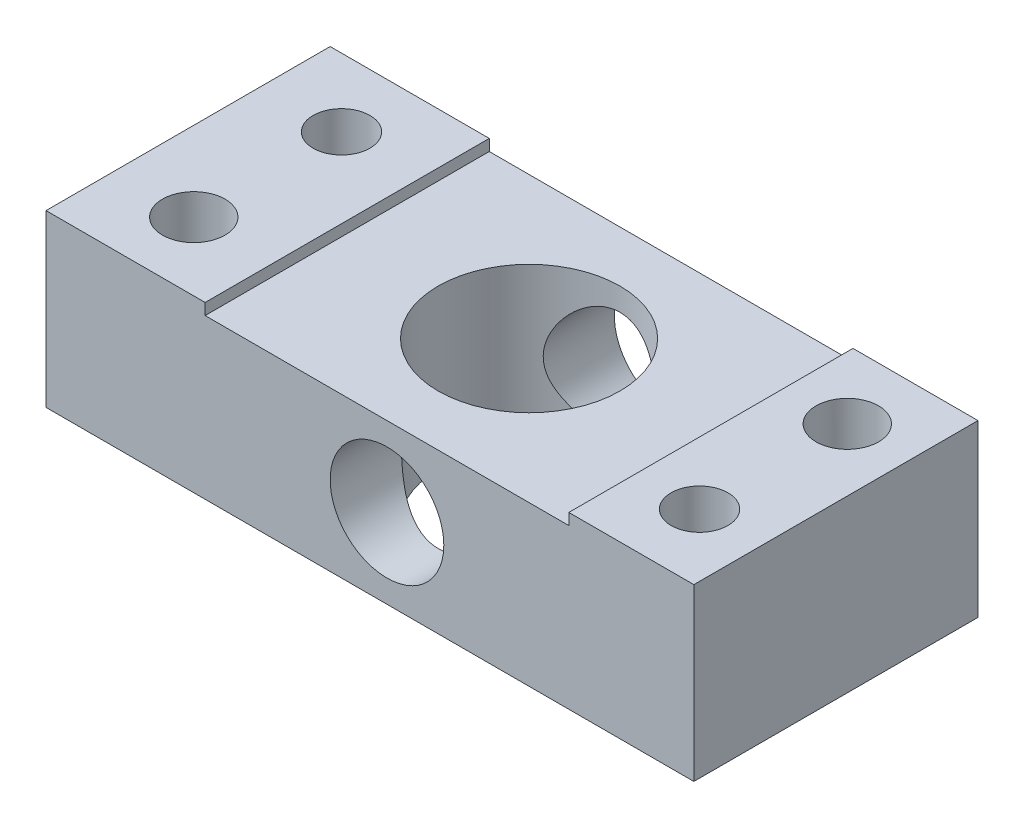
ISO-10303-21;
HEADER;
FILE_DESCRIPTION(('STEP AP214'),'2;1');
FILE_NAME('part.step','',(''),(''),'','','');
FILE_SCHEMA(('AUTOMOTIVE_DESIGN { 1 0 10303 214 1 1 1 1 }'));
ENDSEC;
DATA;
#1=APPLICATION_CONTEXT('core data for automotive mechanical design processes');
#2=APPLICATION_PROTOCOL_DEFINITION('international standard','automotive_design',2000,#1);
#3=PRODUCT_CONTEXT('',#1,'mechanical');
#4=PRODUCT('Part','Part','',(#3));
#5=PRODUCT_RELATED_PRODUCT_CATEGORY('part','',(#4));
#6=PRODUCT_DEFINITION_FORMATION('','',#4);
#7=PRODUCT_DEFINITION_CONTEXT('part definition',#1,'design');
#8=PRODUCT_DEFINITION('design','',#6,#7);
#9=PRODUCT_DEFINITION_SHAPE('','',#8);
#10=(LENGTH_UNIT() NAMED_UNIT(*) SI_UNIT(.MILLI.,.METRE.));
#11=(NAMED_UNIT(*) PLANE_ANGLE_UNIT() SI_UNIT($,.RADIAN.));
#12=(NAMED_UNIT(*) SI_UNIT($,.STERADIAN.) SOLID_ANGLE_UNIT());
#13=UNCERTAINTY_MEASURE_WITH_UNIT(LENGTH_MEASURE(1.E-05),#10,'distance_accuracy_value','');
#14=(GEOMETRIC_REPRESENTATION_CONTEXT(3) GLOBAL_UNCERTAINTY_ASSIGNED_CONTEXT((#13)) GLOBAL_UNIT_ASSIGNED_CONTEXT((#10,
#11,#12)) REPRESENTATION_CONTEXT('',''));
#15=CARTESIAN_POINT('',(0.,0.,0.));
#16=DIRECTION('',(0.,0.,1.));
#17=DIRECTION('',(1.,0.,0.));
#18=AXIS2_PLACEMENT_3D('',#15,#16,#17);
#19=CARTESIAN_POINT('',(23.,58.7,-3.5));
#20=DIRECTION('',(0.,-1.,0.));
#21=DIRECTION('',(0.,0.,-1.));
#22=AXIS2_PLACEMENT_3D('',#19,#20,#21);
#23=CYLINDRICAL_SURFACE('',#22,2.75);
#24=CARTESIAN_POINT('',(23.,15.,-3.5));
#25=DIRECTION('',(0.,1.,0.));
#26=DIRECTION('',(0.,0.,1.));
#27=AXIS2_PLACEMENT_3D('',#24,#25,#26);
#28=CIRCLE('',#27,2.75);
#29=CARTESIAN_POINT('',(23.,15.,-0.750000000000002));
#30=VERTEX_POINT('',#29);
#31=EDGE_CURVE('E278',#30,#30,#28,.T.);
#32=ORIENTED_EDGE('',*,*,#31,.T.);
#33=EDGE_LOOP('',(#32));
#34=FACE_BOUND('',#33,.T.);
#35=CARTESIAN_POINT('',(23.,5.7,-3.5));
#36=DIRECTION('',(0.,-1.,0.));
#37=DIRECTION('',(0.,0.,-1.));
#38=AXIS2_PLACEMENT_3D('',#35,#36,#37);
#39=CIRCLE('',#38,2.75);
#40=CARTESIAN_POINT('',(23.,5.7,-6.25));
#41=VERTEX_POINT('',#40);
#42=EDGE_CURVE('E181',#41,#41,#39,.F.);
#43=ORIENTED_EDGE('',*,*,#42,.F.);
#44=EDGE_LOOP('',(#43));
#45=FACE_BOUND('',#44,.T.);
#46=ADVANCED_FACE('F33',(#34,#45),#23,.F.);
#47=CARTESIAN_POINT('',(-21.5,58.7,9.5));
#48=DIRECTION('',(0.,-1.,0.));
#49=DIRECTION('',(0.,0.,-1.));
#50=AXIS2_PLACEMENT_3D('',#47,#48,#49);
#51=CYLINDRICAL_SURFACE('',#50,2.75);
#52=CARTESIAN_POINT('',(-21.5,15.,9.5));
#53=DIRECTION('',(0.,1.,0.));
#54=DIRECTION('',(0.,0.,1.));
#55=AXIS2_PLACEMENT_3D('',#52,#53,#54);
#56=CIRCLE('',#55,2.75);
#57=CARTESIAN_POINT('',(-21.5,15.,12.25));
#58=VERTEX_POINT('',#57);
#59=EDGE_CURVE('E277',#58,#58,#56,.T.);
#60=ORIENTED_EDGE('',*,*,#59,.T.);
#61=EDGE_LOOP('',(#60));
#62=FACE_BOUND('',#61,.T.);
#63=CARTESIAN_POINT('',(-21.5,5.7,9.5));
#64=DIRECTION('',(0.,-1.,0.));
#65=DIRECTION('',(0.,0.,-1.));
#66=AXIS2_PLACEMENT_3D('',#63,#64,#65);
#67=CIRCLE('',#66,2.75);
#68=CARTESIAN_POINT('',(-21.5,5.7,6.75));
#69=VERTEX_POINT('',#68);
#70=EDGE_CURVE('E178',#69,#69,#67,.F.);
#71=ORIENTED_EDGE('',*,*,#70,.F.);
#72=EDGE_LOOP('',(#71));
#73=FACE_BOUND('',#72,.T.);
#74=ADVANCED_FACE('F212',(#62,#73),#51,.F.);
#75=CARTESIAN_POINT('',(0.,15.,0.));
#76=DIRECTION('',(0.,1.,0.));
#77=DIRECTION('',(0.,0.,1.));
#78=AXIS2_PLACEMENT_3D('',#75,#76,#77);
#79=PLANE('',#78);
#80=CARTESIAN_POINT('',(-21.5,15.,-3.5));
#81=DIRECTION('',(0.,1.,0.));
#82=DIRECTION('',(0.,0.,1.));
#83=AXIS2_PLACEMENT_3D('',#80,#81,#82);
#84=CIRCLE('',#83,2.5);
#85=CARTESIAN_POINT('',(-21.5,15.,-1.));
#86=VERTEX_POINT('',#85);
#87=EDGE_CURVE('E137',#86,#86,#84,.T.);
#88=ORIENTED_EDGE('',*,*,#87,.F.);
#89=EDGE_LOOP('',(#88));
#90=FACE_BOUND('',#89,.T.);
#91=ORIENTED_EDGE('',*,*,#59,.F.);
#92=EDGE_LOOP('',(#91));
#93=FACE_BOUND('',#92,.T.);
#94=DIRECTION('',(0.,0.,1.));
#95=VECTOR('',#94,1.);
#96=CARTESIAN_POINT('',(-14.5,15.,0.));
#97=LINE('',#96,#95);
#98=CARTESIAN_POINT('',(-14.5,15.,-9.5));
#99=VERTEX_POINT('',#98);
#100=CARTESIAN_POINT('',(-14.5,15.,15.5));
#101=VERTEX_POINT('',#100);
#102=EDGE_CURVE('E11',#99,#101,#97,.T.);
#103=ORIENTED_EDGE('',*,*,#102,.F.);
#104=DIRECTION('',(-1.,0.,0.));
#105=VECTOR('',#104,1.);
#106=CARTESIAN_POINT('',(-28.5,15.,-9.5));
#107=LINE('',#106,#105);
#108=CARTESIAN_POINT('',(-28.5,15.,-9.5));
#109=VERTEX_POINT('',#108);
#110=EDGE_CURVE('E57',#99,#109,#107,.T.);
#111=ORIENTED_EDGE('',*,*,#110,.T.);
#112=DIRECTION('',(0.,0.,1.));
#113=VECTOR('',#112,1.);
#114=CARTESIAN_POINT('',(-28.5,15.,-9.5));
#115=LINE('',#114,#113);
#116=CARTESIAN_POINT('',(-28.5,15.,15.5));
#117=VERTEX_POINT('',#116);
#118=EDGE_CURVE('E170',#109,#117,#115,.T.);
#119=ORIENTED_EDGE('',*,*,#118,.T.);
#120=DIRECTION('',(-1.,0.,0.));
#121=VECTOR('',#120,1.);
#122=CARTESIAN_POINT('',(-28.5,15.,15.5));
#123=LINE('',#122,#121);
#124=EDGE_CURVE('E133',#101,#117,#123,.T.);
#125=ORIENTED_EDGE('',*,*,#124,.F.);
#126=EDGE_LOOP('',(#103,#111,#119,#125));
#127=FACE_BOUND('',#126,.T.);
#128=ADVANCED_FACE('F218',(#90,#93,#127),#79,.T.);
#129=CARTESIAN_POINT('',(28.5,15.,-9.5));
#130=DIRECTION('',(-1.,0.,0.));
#131=DIRECTION('',(0.,0.,1.));
#132=AXIS2_PLACEMENT_3D('',#129,#130,#131);
#133=PLANE('',#132);
#134=DIRECTION('',(0.,0.,-1.));
#135=VECTOR('',#134,1.);
#136=CARTESIAN_POINT('',(28.5,0.,-9.5));
#137=LINE('',#136,#135);
#138=CARTESIAN_POINT('',(28.5,0.,15.5));
#139=VERTEX_POINT('',#138);
#140=CARTESIAN_POINT('',(28.5,0.,-9.5));
#141=VERTEX_POINT('',#140);
#142=EDGE_CURVE('E123',#139,#141,#137,.T.);
#143=ORIENTED_EDGE('',*,*,#142,.T.);
#144=DIRECTION('',(0.,-1.,0.));
#145=VECTOR('',#144,1.);
#146=CARTESIAN_POINT('',(28.5,15.,-9.5));
#147=LINE('',#146,#145);
#148=CARTESIAN_POINT('',(28.5,15.,-9.5));
#149=VERTEX_POINT('',#148);
#150=EDGE_CURVE('E175',#149,#141,#147,.T.);
#151=ORIENTED_EDGE('',*,*,#150,.F.);
#152=DIRECTION('',(0.,0.,-1.));
#153=VECTOR('',#152,1.);
#154=CARTESIAN_POINT('',(28.5,15.,-9.5));
#155=LINE('',#154,#153);
#156=CARTESIAN_POINT('',(28.5,15.,15.5));
#157=VERTEX_POINT('',#156);
#158=EDGE_CURVE('E117',#157,#149,#155,.T.);
#159=ORIENTED_EDGE('',*,*,#158,.F.);
#160=DIRECTION('',(0.,1.,0.));
#161=VECTOR('',#160,1.);
#162=CARTESIAN_POINT('',(28.5,15.,15.5));
#163=LINE('',#162,#161);
#164=EDGE_CURVE('E127',#139,#157,#163,.T.);
#165=ORIENTED_EDGE('',*,*,#164,.F.);
#166=EDGE_LOOP('',(#143,#151,#159,#165));
#167=FACE_BOUND('',#166,.T.);
#168=ADVANCED_FACE('F35',(#167),#133,.F.);
#169=CARTESIAN_POINT('',(-28.5,15.,-9.5));
#170=DIRECTION('',(0.,0.,1.));
#171=DIRECTION('',(1.,0.,0.));
#172=AXIS2_PLACEMENT_3D('',#169,#170,#171);
#173=PLANE('',#172);
#174=CARTESIAN_POINT('',(1.5,7.,-9.50000000000001));
#175=DIRECTION('',(0.,0.,1.));
#176=DIRECTION('',(1.,0.,0.));
#177=AXIS2_PLACEMENT_3D('',#174,#175,#176);
#178=CIRCLE('',#177,5.);
#179=CARTESIAN_POINT('',(6.50000000000001,7.,-9.50000000000001));
#180=VERTEX_POINT('',#179);
#181=EDGE_CURVE('E261',#180,#180,#178,.T.);
#182=ORIENTED_EDGE('',*,*,#181,.T.);
#183=EDGE_LOOP('',(#182));
#184=FACE_BOUND('',#183,.T.);
#185=ORIENTED_EDGE('',*,*,#110,.F.);
#186=DIRECTION('',(0.,-1.,0.));
#187=VECTOR('',#186,1.);
#188=CARTESIAN_POINT('',(-14.5,15.,-9.5));
#189=LINE('',#188,#187);
#190=CARTESIAN_POINT('',(-14.5,14.,-9.5));
#191=VERTEX_POINT('',#190);
#192=EDGE_CURVE('E161',#99,#191,#189,.T.);
#193=ORIENTED_EDGE('',*,*,#192,.T.);
#194=DIRECTION('',(1.,0.,0.));
#195=VECTOR('',#194,1.);
#196=CARTESIAN_POINT('',(-28.5,14.,-9.5));
#197=LINE('',#196,#195);
#198=CARTESIAN_POINT('',(17.5,14.,-9.5));
#199=VERTEX_POINT('',#198);
#200=EDGE_CURVE('E77',#191,#199,#197,.T.);
#201=ORIENTED_EDGE('',*,*,#200,.T.);
#202=DIRECTION('',(0.,1.,0.));
#203=VECTOR('',#202,1.);
#204=CARTESIAN_POINT('',(17.5,14.9999999999998,-9.5));
#205=LINE('',#204,#203);
#206=CARTESIAN_POINT('',(17.5,15.,-9.5));
#207=VERTEX_POINT('',#206);
#208=EDGE_CURVE('E157',#199,#207,#205,.T.);
#209=ORIENTED_EDGE('',*,*,#208,.T.);
#210=EDGE_CURVE('E167',#149,#207,#107,.T.);
#211=ORIENTED_EDGE('',*,*,#210,.F.);
#212=ORIENTED_EDGE('',*,*,#150,.T.);
#213=DIRECTION('',(-1.,0.,0.));
#214=VECTOR('',#213,1.);
#215=CARTESIAN_POINT('',(-28.5,0.,-9.5));
#216=LINE('',#215,#214);
#217=CARTESIAN_POINT('',(-28.5,0.,-9.5));
#218=VERTEX_POINT('',#217);
#219=EDGE_CURVE('E69',#141,#218,#216,.T.);
#220=ORIENTED_EDGE('',*,*,#219,.T.);
#221=DIRECTION('',(0.,-1.,0.));
#222=VECTOR('',#221,1.);
#223=CARTESIAN_POINT('',(-28.5,15.,-9.5));
#224=LINE('',#223,#222);
#225=EDGE_CURVE('E116',#109,#218,#224,.T.);
#226=ORIENTED_EDGE('',*,*,#225,.F.);
#227=EDGE_LOOP('',(#185,#193,#201,#209,#211,#212,#220,#226));
#228=FACE_BOUND('',#227,.T.);
#229=ADVANCED_FACE('F251',(#184,#228),#173,.F.);
#230=CARTESIAN_POINT('',(-28.5,15.,-9.5));
#231=DIRECTION('',(1.,0.,0.));
#232=DIRECTION('',(0.,0.,-1.));
#233=AXIS2_PLACEMENT_3D('',#230,#231,#232);
#234=PLANE('',#233);
#235=DIRECTION('',(0.,0.,1.));
#236=VECTOR('',#235,1.);
#237=CARTESIAN_POINT('',(-28.5,0.,-9.5));
#238=LINE('',#237,#236);
#239=CARTESIAN_POINT('',(-28.5,0.,15.5));
#240=VERTEX_POINT('',#239);
#241=EDGE_CURVE('E110',#218,#240,#238,.T.);
#242=ORIENTED_EDGE('',*,*,#241,.T.);
#243=DIRECTION('',(0.,-1.,0.));
#244=VECTOR('',#243,1.);
#245=CARTESIAN_POINT('',(-28.5,0.,15.5));
#246=LINE('',#245,#244);
#247=EDGE_CURVE('E115',#117,#240,#246,.T.);
#248=ORIENTED_EDGE('',*,*,#247,.F.);
#249=ORIENTED_EDGE('',*,*,#118,.F.);
#250=ORIENTED_EDGE('',*,*,#225,.T.);
#251=EDGE_LOOP('',(#242,#248,#249,#250));
#252=FACE_BOUND('',#251,.T.);
#253=ADVANCED_FACE('F112',(#252),#234,.F.);
#254=CARTESIAN_POINT('',(23.,15.,9.5));
#255=DIRECTION('',(0.,1.,0.));
#256=DIRECTION('',(0.,0.,1.));
#257=AXIS2_PLACEMENT_3D('',#254,#255,#256);
#258=CIRCLE('',#257,2.5);
#259=CARTESIAN_POINT('',(23.,15.,12.));
#260=VERTEX_POINT('',#259);
#261=EDGE_CURVE('E134',#260,#260,#258,.T.);
#262=ORIENTED_EDGE('',*,*,#261,.F.);
#263=EDGE_LOOP('',(#262));
#264=FACE_BOUND('',#263,.T.);
#265=ORIENTED_EDGE('',*,*,#31,.F.);
#266=EDGE_LOOP('',(#265));
#267=FACE_BOUND('',#266,.T.);
#268=DIRECTION('',(0.,0.,-1.));
#269=VECTOR('',#268,1.);
#270=CARTESIAN_POINT('',(17.5,15.,0.));
#271=LINE('',#270,#269);
#272=CARTESIAN_POINT('',(17.5,15.,15.5));
#273=VERTEX_POINT('',#272);
#274=EDGE_CURVE('E48',#273,#207,#271,.T.);
#275=ORIENTED_EDGE('',*,*,#274,.F.);
#276=DIRECTION('',(-1.,0.,0.));
#277=VECTOR('',#276,1.);
#278=CARTESIAN_POINT('',(17.5,15.,15.5));
#279=LINE('',#278,#277);
#280=EDGE_CURVE('E142',#157,#273,#279,.T.);
#281=ORIENTED_EDGE('',*,*,#280,.F.);
#282=ORIENTED_EDGE('',*,*,#158,.T.);
#283=ORIENTED_EDGE('',*,*,#210,.T.);
#284=EDGE_LOOP('',(#275,#281,#282,#283));
#285=FACE_BOUND('',#284,.T.);
#286=ADVANCED_FACE('F243',(#264,#267,#285),#79,.T.);
#287=CARTESIAN_POINT('',(0.,0.,0.));
#288=DIRECTION('',(0.,1.,0.));
#289=DIRECTION('',(0.,0.,1.));
#290=AXIS2_PLACEMENT_3D('',#287,#288,#289);
#291=PLANE('',#290);
#292=CARTESIAN_POINT('',(1.50000000000001,0.,3.));
#293=DIRECTION('',(0.,-1.,0.));
#294=DIRECTION('',(0.,0.,-1.));
#295=AXIS2_PLACEMENT_3D('',#292,#293,#294);
#296=CIRCLE('',#295,8.);
#297=CARTESIAN_POINT('',(1.50000000000001,0.,-5.));
#298=VERTEX_POINT('',#297);
#299=EDGE_CURVE('E189',#298,#298,#296,.T.);
#300=ORIENTED_EDGE('',*,*,#299,.F.);
#301=EDGE_LOOP('',(#300));
#302=FACE_BOUND('',#301,.T.);
#303=CARTESIAN_POINT('',(-21.5,0.,9.5));
#304=DIRECTION('',(0.,-1.,0.));
#305=DIRECTION('',(0.,0.,-1.));
#306=AXIS2_PLACEMENT_3D('',#303,#304,#305);
#307=CIRCLE('',#306,5.);
#308=CARTESIAN_POINT('',(-21.5,0.,4.5));
#309=VERTEX_POINT('',#308);
#310=EDGE_CURVE('E292',#309,#309,#307,.T.);
#311=ORIENTED_EDGE('',*,*,#310,.F.);
#312=EDGE_LOOP('',(#311));
#313=FACE_BOUND('',#312,.T.);
#314=CARTESIAN_POINT('',(23.,0.,-3.5));
#315=DIRECTION('',(0.,-1.,0.));
#316=DIRECTION('',(0.,0.,-1.));
#317=AXIS2_PLACEMENT_3D('',#314,#315,#316);
#318=CIRCLE('',#317,5.);
#319=CARTESIAN_POINT('',(23.,0.,-8.5));
#320=VERTEX_POINT('',#319);
#321=EDGE_CURVE('E188',#320,#320,#318,.T.);
#322=ORIENTED_EDGE('',*,*,#321,.F.);
#323=EDGE_LOOP('',(#322));
#324=FACE_BOUND('',#323,.T.);
#325=CARTESIAN_POINT('',(23.,0.,9.5));
#326=DIRECTION('',(0.,-1.,0.));
#327=DIRECTION('',(0.,0.,-1.));
#328=AXIS2_PLACEMENT_3D('',#325,#326,#327);
#329=CIRCLE('',#328,2.5);
#330=CARTESIAN_POINT('',(23.,0.,7.));
#331=VERTEX_POINT('',#330);
#332=EDGE_CURVE('E185',#331,#331,#329,.T.);
#333=ORIENTED_EDGE('',*,*,#332,.F.);
#334=EDGE_LOOP('',(#333));
#335=FACE_BOUND('',#334,.T.);
#336=CARTESIAN_POINT('',(-21.5,0.,-3.5));
#337=DIRECTION('',(0.,-1.,0.));
#338=DIRECTION('',(0.,0.,-1.));
#339=AXIS2_PLACEMENT_3D('',#336,#337,#338);
#340=CIRCLE('',#339,2.5);
#341=CARTESIAN_POINT('',(-21.5,0.,-6.));
#342=VERTEX_POINT('',#341);
#343=EDGE_CURVE('E280',#342,#342,#340,.T.);
#344=ORIENTED_EDGE('',*,*,#343,.F.);
#345=EDGE_LOOP('',(#344));
#346=FACE_BOUND('',#345,.T.);
#347=ORIENTED_EDGE('',*,*,#142,.F.);
#348=DIRECTION('',(1.,0.,0.));
#349=VECTOR('',#348,1.);
#350=CARTESIAN_POINT('',(28.5,0.,15.5));
#351=LINE('',#350,#349);
#352=EDGE_CURVE('E120',#240,#139,#351,.T.);
#353=ORIENTED_EDGE('',*,*,#352,.F.);
#354=ORIENTED_EDGE('',*,*,#241,.F.);
#355=ORIENTED_EDGE('',*,*,#219,.F.);
#356=EDGE_LOOP('',(#347,#353,#354,#355));
#357=FACE_BOUND('',#356,.T.);
#358=ADVANCED_FACE('F121',(#302,#313,#324,#335,#346,#357),#291,.F.);
#359=CARTESIAN_POINT('',(-14.5,14.,-12.5));
#360=DIRECTION('',(0.,-1.,0.));
#361=DIRECTION('',(0.,0.,-1.));
#362=AXIS2_PLACEMENT_3D('',#359,#360,#361);
#363=PLANE('',#362);
#364=CARTESIAN_POINT('',(1.50000000000001,14.,3.));
#365=DIRECTION('',(0.,-1.,0.));
#366=DIRECTION('',(0.,0.,-1.));
#367=AXIS2_PLACEMENT_3D('',#364,#365,#366);
#368=CIRCLE('',#367,8.);
#369=CARTESIAN_POINT('',(1.50000000000001,14.,-5.));
#370=VERTEX_POINT('',#369);
#371=EDGE_CURVE('E186',#370,#370,#368,.T.);
#372=ORIENTED_EDGE('',*,*,#371,.T.);
#373=EDGE_LOOP('',(#372));
#374=FACE_BOUND('',#373,.T.);
#375=DIRECTION('',(0.,0.,1.));
#376=VECTOR('',#375,1.);
#377=CARTESIAN_POINT('',(-14.5,14.,-12.5));
#378=LINE('',#377,#376);
#379=CARTESIAN_POINT('',(-14.5,14.,15.5));
#380=VERTEX_POINT('',#379);
#381=EDGE_CURVE('E154',#191,#380,#378,.T.);
#382=ORIENTED_EDGE('',*,*,#381,.T.);
#383=DIRECTION('',(-1.,0.,0.));
#384=VECTOR('',#383,1.);
#385=CARTESIAN_POINT('',(-14.5,14.,15.5));
#386=LINE('',#385,#384);
#387=CARTESIAN_POINT('',(17.5,14.,15.5));
#388=VERTEX_POINT('',#387);
#389=EDGE_CURVE('E148',#388,#380,#386,.T.);
#390=ORIENTED_EDGE('',*,*,#389,.F.);
#391=DIRECTION('',(0.,0.,1.));
#392=VECTOR('',#391,1.);
#393=CARTESIAN_POINT('',(17.5,14.,-12.5));
#394=LINE('',#393,#392);
#395=EDGE_CURVE('E155',#199,#388,#394,.T.);
#396=ORIENTED_EDGE('',*,*,#395,.F.);
#397=ORIENTED_EDGE('',*,*,#200,.F.);
#398=EDGE_LOOP('',(#382,#390,#396,#397));
#399=FACE_BOUND('',#398,.T.);
#400=ADVANCED_FACE('F236',(#374,#399),#363,.F.);
#401=CARTESIAN_POINT('',(-14.5,15.,-12.5));
#402=DIRECTION('',(-1.,0.,0.));
#403=DIRECTION('',(0.,0.,1.));
#404=AXIS2_PLACEMENT_3D('',#401,#402,#403);
#405=PLANE('',#404);
#406=ORIENTED_EDGE('',*,*,#102,.T.);
#407=DIRECTION('',(0.,1.,0.));
#408=VECTOR('',#407,1.);
#409=CARTESIAN_POINT('',(-14.5,15.,15.5));
#410=LINE('',#409,#408);
#411=EDGE_CURVE('E151',#380,#101,#410,.T.);
#412=ORIENTED_EDGE('',*,*,#411,.F.);
#413=ORIENTED_EDGE('',*,*,#381,.F.);
#414=ORIENTED_EDGE('',*,*,#192,.F.);
#415=EDGE_LOOP('',(#406,#412,#413,#414));
#416=FACE_BOUND('',#415,.T.);
#417=ADVANCED_FACE('F234',(#416),#405,.F.);
#418=CARTESIAN_POINT('',(17.5,15.,-12.5));
#419=DIRECTION('',(1.,0.,0.));
#420=DIRECTION('',(0.,1.,0.));
#421=AXIS2_PLACEMENT_3D('',#418,#419,#420);
#422=PLANE('',#421);
#423=ORIENTED_EDGE('',*,*,#395,.T.);
#424=DIRECTION('',(0.,-1.,0.));
#425=VECTOR('',#424,1.);
#426=CARTESIAN_POINT('',(17.5,14.,15.5));
#427=LINE('',#426,#425);
#428=EDGE_CURVE('E145',#273,#388,#427,.T.);
#429=ORIENTED_EDGE('',*,*,#428,.F.);
#430=ORIENTED_EDGE('',*,*,#274,.T.);
#431=ORIENTED_EDGE('',*,*,#208,.F.);
#432=EDGE_LOOP('',(#423,#429,#430,#431));
#433=FACE_BOUND('',#432,.T.);
#434=ADVANCED_FACE('F230',(#433),#422,.F.);
#435=CARTESIAN_POINT('',(0.,0.,15.5));
#436=DIRECTION('',(0.,0.,-1.));
#437=DIRECTION('',(-1.,0.,0.));
#438=AXIS2_PLACEMENT_3D('',#435,#436,#437);
#439=PLANE('',#438);
#440=CARTESIAN_POINT('',(1.5,7.,15.5));
#441=DIRECTION('',(0.,0.,1.));
#442=DIRECTION('',(1.,0.,0.));
#443=AXIS2_PLACEMENT_3D('',#440,#441,#442);
#444=CIRCLE('',#443,5.);
#445=CARTESIAN_POINT('',(6.50000000000001,7.,15.5));
#446=VERTEX_POINT('',#445);
#447=EDGE_CURVE('E195',#446,#446,#444,.T.);
#448=ORIENTED_EDGE('',*,*,#447,.F.);
#449=EDGE_LOOP('',(#448));
#450=FACE_BOUND('',#449,.T.);
#451=ORIENTED_EDGE('',*,*,#247,.T.);
#452=ORIENTED_EDGE('',*,*,#352,.T.);
#453=ORIENTED_EDGE('',*,*,#164,.T.);
#454=ORIENTED_EDGE('',*,*,#280,.T.);
#455=ORIENTED_EDGE('',*,*,#428,.T.);
#456=ORIENTED_EDGE('',*,*,#389,.T.);
#457=ORIENTED_EDGE('',*,*,#411,.T.);
#458=ORIENTED_EDGE('',*,*,#124,.T.);
#459=EDGE_LOOP('',(#451,#452,#453,#454,#455,#456,#457,#458));
#460=FACE_BOUND('',#459,.T.);
#461=ADVANCED_FACE('F130',(#450,#460),#439,.F.);
#462=CARTESIAN_POINT('',(-21.5,58.7,-3.5));
#463=DIRECTION('',(0.,-1.,0.));
#464=DIRECTION('',(0.,0.,-1.));
#465=AXIS2_PLACEMENT_3D('',#462,#463,#464);
#466=CYLINDRICAL_SURFACE('',#465,2.5);
#467=ORIENTED_EDGE('',*,*,#87,.T.);
#468=EDGE_LOOP('',(#467));
#469=FACE_BOUND('',#468,.T.);
#470=ORIENTED_EDGE('',*,*,#343,.T.);
#471=EDGE_LOOP('',(#470));
#472=FACE_BOUND('',#471,.T.);
#473=ADVANCED_FACE('F229',(#469,#472),#466,.F.);
#474=CARTESIAN_POINT('',(23.,58.7,9.5));
#475=DIRECTION('',(0.,-1.,0.));
#476=DIRECTION('',(0.,0.,-1.));
#477=AXIS2_PLACEMENT_3D('',#474,#475,#476);
#478=CYLINDRICAL_SURFACE('',#477,2.5);
#479=ORIENTED_EDGE('',*,*,#261,.T.);
#480=EDGE_LOOP('',(#479));
#481=FACE_BOUND('',#480,.T.);
#482=ORIENTED_EDGE('',*,*,#332,.T.);
#483=EDGE_LOOP('',(#482));
#484=FACE_BOUND('',#483,.T.);
#485=ADVANCED_FACE('F225',(#481,#484),#478,.F.);
#486=CARTESIAN_POINT('',(-21.5,5.7,9.5));
#487=DIRECTION('',(0.,-1.,0.));
#488=DIRECTION('',(0.,0.,-1.));
#489=AXIS2_PLACEMENT_3D('',#486,#487,#488);
#490=PLANE('',#489);
#491=CARTESIAN_POINT('',(-21.5,5.7,9.5));
#492=DIRECTION('',(0.,-1.,0.));
#493=DIRECTION('',(0.,0.,-1.));
#494=AXIS2_PLACEMENT_3D('',#491,#492,#493);
#495=CIRCLE('',#494,5.);
#496=CARTESIAN_POINT('',(-21.5,5.7,4.5));
#497=VERTEX_POINT('',#496);
#498=EDGE_CURVE('E182',#497,#497,#495,.T.);
#499=ORIENTED_EDGE('',*,*,#498,.T.);
#500=EDGE_LOOP('',(#499));
#501=FACE_BOUND('',#500,.T.);
#502=ORIENTED_EDGE('',*,*,#70,.T.);
#503=EDGE_LOOP('',(#502));
#504=FACE_BOUND('',#503,.T.);
#505=ADVANCED_FACE('F326',(#501,#504),#490,.T.);
#506=CARTESIAN_POINT('',(-21.5,5.7,9.5));
#507=DIRECTION('',(0.,-1.,0.));
#508=DIRECTION('',(0.,0.,-1.));
#509=AXIS2_PLACEMENT_3D('',#506,#507,#508);
#510=CYLINDRICAL_SURFACE('',#509,5.);
#511=ORIENTED_EDGE('',*,*,#498,.F.);
#512=EDGE_LOOP('',(#511));
#513=FACE_BOUND('',#512,.T.);
#514=ORIENTED_EDGE('',*,*,#310,.T.);
#515=EDGE_LOOP('',(#514));
#516=FACE_BOUND('',#515,.T.);
#517=ADVANCED_FACE('F335',(#513,#516),#510,.F.);
#518=CARTESIAN_POINT('',(23.,5.7,-3.5));
#519=DIRECTION('',(0.,-1.,0.));
#520=DIRECTION('',(0.,0.,-1.));
#521=AXIS2_PLACEMENT_3D('',#518,#519,#520);
#522=PLANE('',#521);
#523=CARTESIAN_POINT('',(23.,5.7,-3.5));
#524=DIRECTION('',(0.,-1.,0.));
#525=DIRECTION('',(0.,0.,-1.));
#526=AXIS2_PLACEMENT_3D('',#523,#524,#525);
#527=CIRCLE('',#526,5.);
#528=CARTESIAN_POINT('',(23.,5.7,-8.5));
#529=VERTEX_POINT('',#528);
#530=EDGE_CURVE('E289',#529,#529,#527,.T.);
#531=ORIENTED_EDGE('',*,*,#530,.T.);
#532=EDGE_LOOP('',(#531));
#533=FACE_BOUND('',#532,.T.);
#534=ORIENTED_EDGE('',*,*,#42,.T.);
#535=EDGE_LOOP('',(#534));
#536=FACE_BOUND('',#535,.T.);
#537=ADVANCED_FACE('F331',(#533,#536),#522,.T.);
#538=CARTESIAN_POINT('',(23.,5.7,-3.5));
#539=DIRECTION('',(0.,-1.,0.));
#540=DIRECTION('',(0.,0.,-1.));
#541=AXIS2_PLACEMENT_3D('',#538,#539,#540);
#542=CYLINDRICAL_SURFACE('',#541,5.);
#543=ORIENTED_EDGE('',*,*,#530,.F.);
#544=EDGE_LOOP('',(#543));
#545=FACE_BOUND('',#544,.T.);
#546=ORIENTED_EDGE('',*,*,#321,.T.);
#547=EDGE_LOOP('',(#546));
#548=FACE_BOUND('',#547,.T.);
#549=ADVANCED_FACE('F307',(#545,#548),#542,.F.);
#550=CARTESIAN_POINT('',(1.50000000000001,171.,3.));
#551=DIRECTION('',(0.,-1.,0.));
#552=DIRECTION('',(0.,0.,-1.));
#553=AXIS2_PLACEMENT_3D('',#550,#551,#552);
#554=CYLINDRICAL_SURFACE('',#553,8.);
#555=CARTESIAN_POINT('',(1.50000000000001,12.,-5.));
#556=CARTESIAN_POINT('',(1.62707971819415,11.999999703158,-4.99999969932038));
#557=CARTESIAN_POINT('',(1.75416597635317,11.9951487716904,-4.99696526438073));
#558=CARTESIAN_POINT('',(2.0073656813987,11.9758125430163,-4.98490163345175));
#559=CARTESIAN_POINT('',(2.13347868146304,11.9613230593219,-4.97586983252039));
#560=CARTESIAN_POINT('',(2.38387923558096,11.9228878347618,-4.95201844653618));
#561=CARTESIAN_POINT('',(2.50816396386936,11.898928784368,-4.93719071559646));
#562=CARTESIAN_POINT('',(2.75388007858572,11.8418697843255,-4.90210083284868));
#563=CARTESIAN_POINT('',(2.87531023423721,11.8087659675088,-4.88183638204784));
#564=CARTESIAN_POINT('',(3.11383677448203,11.7340323987006,-4.83646507337636));
#565=CARTESIAN_POINT('',(3.23095311667824,11.6924499350516,-4.81138511664483));
#566=CARTESIAN_POINT('',(3.46091650164604,11.6011015247516,-4.75685494898749));
#567=CARTESIAN_POINT('',(3.57376186971094,11.551332408071,-4.72740304559261));
#568=CARTESIAN_POINT('',(3.9049119091141,11.3905033579943,-4.63340708241437));
#569=CARTESIAN_POINT('',(4.11609848167962,11.2678365497588,-4.5631697348111));
#570=CARTESIAN_POINT('',(4.53193014433839,10.9844460469625,-4.40680295707224));
#571=CARTESIAN_POINT('',(4.7347059896329,10.821465463445,-4.31985233528323));
#572=CARTESIAN_POINT('',(5.11195776992339,10.4671006083036,-4.1412401292643));
#573=CARTESIAN_POINT('',(5.28639500697959,10.2756781690211,-4.04957232454122));
#574=CARTESIAN_POINT('',(5.53551059577152,9.95571425020991,-3.90836217121019));
#575=CARTESIAN_POINT('',(5.62074022592499,9.83571286902763,-3.85772204075824));
#576=CARTESIAN_POINT('',(5.78074637131475,9.58784896365527,-3.75899646823101));
#577=CARTESIAN_POINT('',(5.85552092872512,9.4599849735435,-3.71091150568103));
#578=CARTESIAN_POINT('',(5.99385262588458,9.197115812324,-3.61907677956953));
#579=CARTESIAN_POINT('',(6.05742717693475,9.06212215723772,-3.57532033426424));
#580=CARTESIAN_POINT('',(6.17278116226384,8.78537755230287,-3.49385156056843));
#581=CARTESIAN_POINT('',(6.22456056034897,8.6436265817209,-3.45613925072462));
#582=CARTESIAN_POINT('',(6.30367778250346,8.39186641707946,-3.39737739560479));
#583=CARTESIAN_POINT('',(6.33387146386474,8.28316394558813,-3.37454329188128));
#584=CARTESIAN_POINT('',(6.38698936981771,8.06308085312617,-3.33391313113233));
#585=CARTESIAN_POINT('',(6.40991524122179,7.95170084502076,-3.31611593289309));
#586=CARTESIAN_POINT('',(6.44817199977537,7.72702366166044,-3.28619004435451));
#587=CARTESIAN_POINT('',(6.46351189515875,7.61372892633182,-3.27405463174268));
#588=CARTESIAN_POINT('',(6.48640391146144,7.38585870918519,-3.25587655110008));
#589=CARTESIAN_POINT('',(6.49395573327639,7.27128317834848,-3.24983411707301));
#590=CARTESIAN_POINT('',(6.50115324292109,7.0414413461846,-3.24407626191297));
#591=CARTESIAN_POINT('',(6.50077951510322,6.92617404020463,-3.24437637846302));
#592=CARTESIAN_POINT('',(6.49208386707443,6.69609400648393,-3.2513301416873));
#593=CARTESIAN_POINT('',(6.4837590327066,6.58128146091011,-3.25798611784494));
#594=CARTESIAN_POINT('',(6.45928874246479,6.35297891802111,-3.27739584443857));
#595=CARTESIAN_POINT('',(6.44314081984502,6.23948934942843,-3.29015151819107));
#596=CARTESIAN_POINT('',(6.4032719377126,6.01461379682137,-3.32127805222651));
#597=CARTESIAN_POINT('',(6.37954784440758,5.90322870352718,-3.33965123599108));
#598=CARTESIAN_POINT('',(6.29874186577055,5.57838001570954,-3.40129934062341));
#599=CARTESIAN_POINT('',(6.23140686716692,5.3687075221513,-3.45162709323741));
#600=CARTESIAN_POINT('',(6.07160139234777,4.96331791154015,-3.565824165778));
#601=CARTESIAN_POINT('',(5.97912202607653,4.7676057612665,-3.62969827340047));
#602=CARTESIAN_POINT('',(5.75180409904384,4.3566853467508,-3.77818972806845));
#603=CARTESIAN_POINT('',(5.6122797851601,4.14466479771905,-3.86445305269835));
#604=CARTESIAN_POINT('',(5.30349790123425,3.74465081625976,-4.04023909017201));
#605=CARTESIAN_POINT('',(5.13420977102789,3.55668242559802,-4.12976507734762));
#606=CARTESIAN_POINT('',(4.84462792787133,3.28043145193569,-4.26825220927602));
#607=CARTESIAN_POINT('',(4.73332743959703,3.18325719879606,-4.31856628212432));
#608=CARTESIAN_POINT('',(4.50184758289934,2.99864888721538,-4.4165140520612));
#609=CARTESIAN_POINT('',(4.38167150233174,2.91121125176429,-4.46414873029401));
#610=CARTESIAN_POINT('',(4.13291547069674,2.74676677991486,-4.55548277586876));
#611=CARTESIAN_POINT('',(4.00433330649265,2.66976270697271,-4.59918109959603));
#612=CARTESIAN_POINT('',(3.73953943503378,2.52707471186916,-4.68138405457136));
#613=CARTESIAN_POINT('',(3.6033325054106,2.46138380385836,-4.71989188771748));
#614=CARTESIAN_POINT('',(3.33158498937008,2.34533113524692,-4.78870197133489));
#615=CARTESIAN_POINT('',(3.19639792018988,2.29433770222548,-4.81933279806533));
#616=CARTESIAN_POINT('',(2.92097512774062,2.20397901038103,-4.87404113157595));
#617=CARTESIAN_POINT('',(2.78074233969551,2.16460710989418,-4.89812238079521));
#618=CARTESIAN_POINT('',(2.49648450286852,2.09813260159342,-4.93899345279391));
#619=CARTESIAN_POINT('',(2.35246298980258,2.07101895588676,-4.95578983464414));
#620=CARTESIAN_POINT('',(2.06191536170766,2.02950965002699,-4.98157299247508));
#621=CARTESIAN_POINT('',(1.91538967888074,2.01511181736518,-4.99056110250213));
#622=CARTESIAN_POINT('',(1.64323803918903,2.000479835907,-4.99969867025939));
#623=CARTESIAN_POINT('',(1.51774140785681,1.99845913591099,-5.00096292697891));
#624=CARTESIAN_POINT('',(1.2670336322336,2.0038572215042,-4.99758945182604));
#625=CARTESIAN_POINT('',(1.14182246972724,2.01127538690751,-4.9929521077216));
#626=CARTESIAN_POINT('',(0.892672165503385,2.03544377752682,-4.97789005521254));
#627=CARTESIAN_POINT('',(0.768732910699923,2.05219316564845,-4.96746586594014));
#628=CARTESIAN_POINT('',(0.523030304778353,2.09479069267733,-4.94108300214141));
#629=CARTESIAN_POINT('',(0.401266992076648,2.12063899206003,-4.92512423000295));
#630=CARTESIAN_POINT('',(0.165491654211473,2.17990944719133,-4.88877344649023));
#631=CARTESIAN_POINT('',(0.0513633301907592,2.2129926441146,-4.86858112898481));
#632=CARTESIAN_POINT('',(-0.173502317417579,2.28688903264245,-4.82384532964922));
#633=CARTESIAN_POINT('',(-0.284238469434779,2.32770486070159,-4.7993003639589));
#634=CARTESIAN_POINT('',(-0.610438453041587,2.46114977693267,-4.7198451952159));
#635=CARTESIAN_POINT('',(-0.820075653935253,2.56482271187943,-4.65908557136377));
#636=CARTESIAN_POINT('',(-1.24037159603305,2.8100720636279,-4.51959499245697));
#637=CARTESIAN_POINT('',(-1.44899750641245,2.95441813658446,-4.43966908727207));
#638=CARTESIAN_POINT('',(-1.84056091506499,3.27117159666723,-4.27228030716762));
#639=CARTESIAN_POINT('',(-2.02346945040511,3.44361015738438,-4.18480911073449));
#640=CARTESIAN_POINT('',(-2.38590040481164,3.84054496691985,-3.99623419569616));
#641=CARTESIAN_POINT('',(-2.56107692783136,4.06896439134318,-3.89499476958427));
#642=CARTESIAN_POINT('',(-2.87121122716532,4.5554875844223,-3.70267107654715));
#643=CARTESIAN_POINT('',(-3.00619684735977,4.81357062978902,-3.61157980658315));
#644=CARTESIAN_POINT('',(-3.20739703071134,5.29881395769186,-3.46933988973206));
#645=CARTESIAN_POINT('',(-3.28209607779641,5.52111572810205,-3.41382106492075));
#646=CARTESIAN_POINT('',(-3.37056932795047,5.86356548831938,-3.34656596743546));
#647=CARTESIAN_POINT('',(-3.39612834571372,5.97919012334316,-3.32682054908637));
#648=CARTESIAN_POINT('',(-3.43906627660446,6.21278699009801,-3.29335959003545));
#649=CARTESIAN_POINT('',(-3.45644870968554,6.33075818881341,-3.27964145480505));
#650=CARTESIAN_POINT('',(-3.48283345322303,6.56893702346895,-3.25872646567768));
#651=CARTESIAN_POINT('',(-3.49178464992502,6.68915385080564,-3.25156939465669));
#652=CARTESIAN_POINT('',(-3.50096567028373,6.93013492270192,-3.24422754057756));
#653=CARTESIAN_POINT('',(-3.50119553239924,7.05089916484522,-3.24404272677361));
#654=CARTESIAN_POINT('',(-3.49292458618068,7.29197552581113,-3.25065867247708));
#655=CARTESIAN_POINT('',(-3.48442112542226,7.41228749613128,-3.2574615542391));
#656=CARTESIAN_POINT('',(-3.45884706925013,7.65139366298224,-3.27774556876195));
#657=CARTESIAN_POINT('',(-3.44177659470705,7.77018788090254,-3.2912266073017));
#658=CARTESIAN_POINT('',(-3.38153513763473,8.10397138997808,-3.33822773980263));
#659=CARTESIAN_POINT('',(-3.32847742875035,8.31623776002511,-3.37907576446225));
#660=CARTESIAN_POINT('',(-3.19670428935883,8.72857970115401,-3.47669777004122));
#661=CARTESIAN_POINT('',(-3.11797815957074,8.92865014730156,-3.53347839071251));
#662=CARTESIAN_POINT('',(-2.92410573147435,9.34237556307302,-3.66655793133304));
#663=CARTESIAN_POINT('',(-2.80533683658203,9.55380395596853,-3.74449249142917));
#664=CARTESIAN_POINT('',(-2.54000963034606,9.95575070468091,-3.90670498235136));
#665=CARTESIAN_POINT('',(-2.39342885237776,10.1462519576018,-3.99098800808705));
#666=CARTESIAN_POINT('',(-2.04264024371937,10.5400839692072,-4.17608994782601));
#667=CARTESIAN_POINT('',(-1.83276887019884,10.7384778900905,-4.27687640364452));
#668=CARTESIAN_POINT('',(-1.49268031590092,11.0081002301602,-4.42018359046304));
#669=CARTESIAN_POINT('',(-1.37498419390474,11.0933783182535,-4.46667962522411));
#670=CARTESIAN_POINT('',(-1.13162062416604,11.2539148600255,-4.55588019054725));
#671=CARTESIAN_POINT('',(-1.00595739502894,11.3291785520034,-4.59858669939736));
#672=CARTESIAN_POINT('',(-0.746955851175514,11.4691062705264,-4.67916888890582));
#673=CARTESIAN_POINT('',(-0.613599663961316,11.5337441512262,-4.71703260409719));
#674=CARTESIAN_POINT('',(-0.340391273506287,11.6513500607965,-4.78670745066038));
#675=CARTESIAN_POINT('',(-0.200542879036512,11.7043248298478,-4.81852207637899));
#676=CARTESIAN_POINT('',(0.0842503081310166,11.7977128873129,-4.87506644788239));
#677=CARTESIAN_POINT('',(0.229180184077506,11.8381599927073,-4.89981525263675));
#678=CARTESIAN_POINT('',(0.523087546535135,11.9059510328588,-4.9415135957936));
#679=CARTESIAN_POINT('',(0.672061961678604,11.9333046319352,-4.95846888622183));
#680=CARTESIAN_POINT('',(0.934291965371906,11.9691815010319,-4.98076605772892));
#681=CARTESIAN_POINT('',(1.04698795603889,11.9807255040017,-4.98796542217808));
#682=CARTESIAN_POINT('',(1.27312086365106,11.9961351236057,-4.99758267549434));
#683=CARTESIAN_POINT('',(1.38655782601992,12.0000002649865,-5.00000026841223));
#684=CARTESIAN_POINT('',(1.50000000000001,12.,-5.));
#685=B_SPLINE_CURVE_WITH_KNOTS('',3,(#555,#556,#557,#558,#559,#560,#561,#562,#563,#564,#565,
#566,#567,#568,#569,#570,#571,#572,#573,#574,#575,#576,#577,#578,#579,#580,#581,#582,#583,#584,
#585,#586,#587,#588,#589,#590,#591,#592,#593,#594,#595,#596,#597,#598,#599,#600,#601,#602,#603,
#604,#605,#606,#607,#608,#609,#610,#611,#612,#613,#614,#615,#616,#617,#618,#619,#620,#621,#622,
#623,#624,#625,#626,#627,#628,#629,#630,#631,#632,#633,#634,#635,#636,#637,#638,#639,#640,#641,
#642,#643,#644,#645,#646,#647,#648,#649,#650,#651,#652,#653,#654,#655,#656,#657,#658,#659,#660,
#661,#662,#663,#664,#665,#666,#667,#668,#669,#670,#671,#672,#673,#674,#675,#676,#677,#678,#679,
#680,#681,#682,#683,#684),.UNSPECIFIED.,.T.,.F.,(4,2,2,2,2,2,2,2,2,2,2,2,2,2,2,2,2,2,2,2,2,2,2,
2,2,2,2,2,2,2,2,2,2,2,2,2,2,2,2,2,2,2,2,2,2,2,2,2,2,2,2,2,2,2,2,2,2,2,2,2,2,2,2,2,4),(0.,
0.381122813878229,0.762411275945245,1.14423755771083,1.52622555522556,1.90613865065076,
2.2861992035346,3.04547146930923,3.86537873527686,4.68639638614618,5.15288943324734,
5.61946971957747,6.08531814323785,6.55116799634916,6.89615022205286,7.24105422230075,
7.58554766475416,7.93005433713581,8.27540506342305,8.62088241265913,8.96646876744119,
9.31219825544433,9.98712845371039,10.6622975916544,11.463592889512,12.2657157783383,
12.7334704505957,13.2010527095967,13.6687585723722,14.1361745843372,14.5786070973028,
15.0207862699487,15.4625664873667,15.9042712116065,16.280349331717,16.6564027426817,
17.0324224237136,17.4084487368524,17.7696430642803,18.1309607639224,18.8530325398091,
19.6479898222925,20.4438353357779,21.355208937219,22.2659496705469,22.9857781952855,
23.3455439181714,23.705154622762,24.0669316687914,24.4287071194786,24.7905924786019,
25.1524727320855,25.8172983911075,26.482401522191,27.2437925511324,28.0058012758041,
28.9187931910578,29.3761295657643,29.8332257699805,30.2914303932663,30.7493695182481,
31.2060614935589,31.6624158626754,32.0026174741983,32.3428401405226),.UNSPECIFIED.);
#686=CARTESIAN_POINT('',(1.50000000000001,12.,-5.));
#687=VERTEX_POINT('',#686);
#688=EDGE_CURVE('E37',#687,#687,#685,.T.);
#689=ORIENTED_EDGE('',*,*,#688,.T.);
#690=EDGE_LOOP('',(#689));
#691=FACE_BOUND('',#690,.T.);
#692=CARTESIAN_POINT('',(6.50000000000001,7.,9.2449979983984));
#693=CARTESIAN_POINT('',(6.49999874728377,7.12430999708492,9.24499999083319));
#694=CARTESIAN_POINT('',(6.49535477639503,7.24864391192218,9.24872594235153));
#695=CARTESIAN_POINT('',(6.47686385741702,7.49624234521784,9.26346233698878));
#696=CARTESIAN_POINT('',(6.46301148892208,7.61950619047429,9.27447707053879));
#697=CARTESIAN_POINT('',(6.42631685582623,7.86413289410849,9.30332817855702));
#698=CARTESIAN_POINT('',(6.40345645667282,7.98549140107075,9.32117831167982));
#699=CARTESIAN_POINT('',(6.34912073775946,8.22521846002731,9.36295500797281));
#700=CARTESIAN_POINT('',(6.31764111134032,8.34358548492503,9.38688460836052));
#701=CARTESIAN_POINT('',(6.21155634327381,8.69098285176996,9.46598710467671));
#702=CARTESIAN_POINT('',(6.1249307188155,8.91472159134201,9.52878844336903));
#703=CARTESIAN_POINT('',(5.92286683667303,9.34407629105235,9.66732308206754));
#704=CARTESIAN_POINT('',(5.80742779304936,9.54969175663766,9.74305673480881));
#705=CARTESIAN_POINT('',(5.53296948836378,9.9674414130167,9.9111800262691));
#706=CARTESIAN_POINT('',(5.37018134056582,10.1767495295057,10.0044411262893));
#707=CARTESIAN_POINT('',(5.01319765959103,10.5675602565304,10.1901252452099));
#708=CARTESIAN_POINT('',(4.81897506071619,10.7490386404933,10.2825474687441));
#709=CARTESIAN_POINT('',(4.49356128179165,11.0076062614924,10.419889718464));
#710=CARTESIAN_POINT('',(4.37212880091628,11.095548293417,10.4678519070092));
#711=CARTESIAN_POINT('',(4.12078661715024,11.2607595171728,10.5597187627531));
#712=CARTESIAN_POINT('',(3.99088050482953,11.3380331868517,10.6036251297313));
#713=CARTESIAN_POINT('',(3.72333771815378,11.4810453683149,10.6861147812774));
#714=CARTESIAN_POINT('',(3.58570487145724,11.546789526158,10.7247006693202));
#715=CARTESIAN_POINT('',(3.30358193532004,11.6658891364008,10.795397530773));
#716=CARTESIAN_POINT('',(3.15909309867121,11.7192468417516,10.8275096815403));
#717=CARTESIAN_POINT('',(2.87943032429723,11.8079574186921,10.8813287911058));
#718=CARTESIAN_POINT('',(2.7448010642007,11.8445886419675,10.9037613558382));
#719=CARTESIAN_POINT('',(2.4720506929037,11.9065942754943,10.9419184431085));
#720=CARTESIAN_POINT('',(2.33393016562644,11.9319705551671,10.9576440796358));
#721=CARTESIAN_POINT('',(2.05553446230962,11.9710283882416,10.9819101205564));
#722=CARTESIAN_POINT('',(1.91526115833719,11.9847195748372,10.9904564434862));
#723=CARTESIAN_POINT('',(1.63381008494377,12.0001950853528,11.0001195552585));
#724=CARTESIAN_POINT('',(1.49263242150179,12.0019807797834,11.0012371992595));
#725=CARTESIAN_POINT('',(1.22976039010063,11.9941830684201,10.9963654435303));
#726=CARTESIAN_POINT('',(1.10800068992707,11.9860972278415,10.9913121758432));
#727=CARTESIAN_POINT('',(0.865706407693864,11.9610995068923,10.9757389883304));
#728=CARTESIAN_POINT('',(0.745172203456575,11.9441849840002,10.9652174317898));
#729=CARTESIAN_POINT('',(0.506249583709704,11.9017519566739,10.9389478792848));
#730=CARTESIAN_POINT('',(0.387860456318972,11.8762363638823,10.9232016520092));
#731=CARTESIAN_POINT('',(0.153926844458947,11.8169153600419,10.8868328308457));
#732=CARTESIAN_POINT('',(0.0383834785892829,11.783106744678,10.8662083521757));
#733=CARTESIAN_POINT('',(-0.303416238926859,11.6696140678729,10.7975383734526));
#734=CARTESIAN_POINT('',(-0.524472504880601,11.5779300729128,10.7427388695626));
#735=CARTESIAN_POINT('',(-0.948115887861137,11.3661156077167,10.6194209119633));
#736=CARTESIAN_POINT('',(-1.1506987826293,11.2459786567544,10.5508993333287));
#737=CARTESIAN_POINT('',(-1.55883635403528,10.9638966802352,10.3957341418452));
#738=CARTESIAN_POINT('',(-1.7616234577039,10.7986093354655,10.3078964939485));
#739=CARTESIAN_POINT('',(-2.13842034253163,10.4394425966505,10.1278021607068));
#740=CARTESIAN_POINT('',(-2.3123875088261,10.2455216500341,10.0355391870356));
#741=CARTESIAN_POINT('',(-2.55999923159469,9.92199806035766,9.89398778931582));
#742=CARTESIAN_POINT('',(-2.64440430037547,9.80103153254676,9.84343529038729));
#743=CARTESIAN_POINT('',(-2.80267035241461,9.5512511400869,9.7450499014227));
#744=CARTESIAN_POINT('',(-2.87652935467605,9.42243580756731,9.69721752335299));
#745=CARTESIAN_POINT('',(-3.01291782494084,9.15770926568204,9.60608014442446));
#746=CARTESIAN_POINT('',(-3.0754664481639,9.02181056536115,9.56276754252838));
#747=CARTESIAN_POINT('',(-3.18865167394019,8.74330768244433,9.48238923774268));
#748=CARTESIAN_POINT('',(-3.23928834757019,8.60070353986484,9.44532349757936));
#749=CARTESIAN_POINT('',(-3.31614194168603,8.34808415551627,9.38799110889139));
#750=CARTESIAN_POINT('',(-3.34527833481625,8.23937010533179,9.36587062744548));
#751=CARTESIAN_POINT('',(-3.39628944573214,8.01935900201234,9.3267200135842));
#752=CARTESIAN_POINT('',(-3.41816581196151,7.90806254138197,9.30968872571675));
#753=CARTESIAN_POINT('',(-3.45434333722363,7.68365449314801,9.2813224765214));
#754=CARTESIAN_POINT('',(-3.46865318123362,7.57054514079621,9.26998098512218));
#755=CARTESIAN_POINT('',(-3.48951663397228,7.34315827466714,9.25339132178237));
#756=CARTESIAN_POINT('',(-3.49606992689043,7.22888071351691,9.24814339794355));
#757=CARTESIAN_POINT('',(-3.50131530513999,6.99978624367253,9.24394563972607));
#758=CARTESIAN_POINT('',(-3.49999077198392,6.88496870571455,9.2450091194138));
#759=CARTESIAN_POINT('',(-3.48946310366481,6.65588941016004,9.25342323341975));
#760=CARTESIAN_POINT('',(-3.48025707456074,6.54162787221673,9.26077617711313));
#761=CARTESIAN_POINT('',(-3.45410620951325,6.31450756435812,9.28148941326478));
#762=CARTESIAN_POINT('',(-3.43715876465219,6.20164928053214,9.29485173090555));
#763=CARTESIAN_POINT('',(-3.3957794498311,5.97809631805293,9.32708655414446));
#764=CARTESIAN_POINT('',(-3.37134448334738,5.86740255474048,9.3459613393153));
#765=CARTESIAN_POINT('',(-3.28821642821574,5.54325885683994,9.40919739263554));
#766=CARTESIAN_POINT('',(-3.21921780239626,5.3337222728976,9.46057720915498));
#767=CARTESIAN_POINT('',(-3.05609149726001,4.92881368169566,9.57662484324881));
#768=CARTESIAN_POINT('',(-2.96195489902187,4.73344673315011,9.6412973751829));
#769=CARTESIAN_POINT('',(-2.73062377482239,4.32279424522163,9.79148506979738));
#770=CARTESIAN_POINT('',(-2.58864375810927,4.11079804804686,9.87862419429458));
#771=CARTESIAN_POINT('',(-2.27473221644168,3.71123154714044,10.0557691635421));
#772=CARTESIAN_POINT('',(-2.10276961587648,3.52368694238688,10.14577790264));
#773=CARTESIAN_POINT('',(-1.80924585333197,3.24890562614596,10.2844467919023));
#774=CARTESIAN_POINT('',(-1.69677534649598,3.15257691600596,10.3346230901993));
#775=CARTESIAN_POINT('',(-1.46297696798608,2.9697678850175,10.4321453931641));
#776=CARTESIAN_POINT('',(-1.34165245789285,2.88328385805497,10.47949245971));
#777=CARTESIAN_POINT('',(-1.09064393379972,2.72087455723812,10.5700974338104));
#778=CARTESIAN_POINT('',(-0.960958229634682,2.64495142806152,10.6133545102116));
#779=CARTESIAN_POINT('',(-0.694021095848224,2.50455889631043,10.6945247517604));
#780=CARTESIAN_POINT('',(-0.556774478634836,2.44008231606231,10.7324412626592));
#781=CARTESIAN_POINT('',(-0.283894885794429,2.32686077625645,10.7997618004541));
#782=CARTESIAN_POINT('',(-0.148646314020919,2.27741106388233,10.8295365885613));
#783=CARTESIAN_POINT('',(0.12672833024763,2.19011749826263,10.8824973891016));
#784=CARTESIAN_POINT('',(0.266851526885601,2.15226692702146,10.9056872148427));
#785=CARTESIAN_POINT('',(0.550715128452283,2.08878924112084,10.9447697096006));
#786=CARTESIAN_POINT('',(0.694452262369675,2.06315146409548,10.9606687433803));
#787=CARTESIAN_POINT('',(0.984252109395642,2.02452399187736,10.9846809820715));
#788=CARTESIAN_POINT('',(1.13031443372691,2.01153220435852,10.9927954749611));
#789=CARTESIAN_POINT('',(1.40154576015365,1.9994081795229,11.000368998362));
#790=CARTESIAN_POINT('',(1.52660919011079,1.99851000290151,11.000930859058));
#791=CARTESIAN_POINT('',(1.7763844265485,2.00608130773386,10.9961999732733));
#792=CARTESIAN_POINT('',(1.90109611403359,2.01455364895285,10.9909054394939));
#793=CARTESIAN_POINT('',(2.14910504846571,2.04074537410253,10.9745910301541));
#794=CARTESIAN_POINT('',(2.27240289311327,2.05846069130529,10.9635736725331));
#795=CARTESIAN_POINT('',(2.51678782002796,2.10290136456075,10.936074015268));
#796=CARTESIAN_POINT('',(2.63787403075122,2.12963019514162,10.9195896082267));
#797=CARTESIAN_POINT('',(2.8727696067634,2.19066487388263,10.8822041771513));
#798=CARTESIAN_POINT('',(2.98668509743701,2.2246709770358,10.8614789932863));
#799=CARTESIAN_POINT('',(3.21105112688167,2.30038928433009,10.8157172820285));
#800=CARTESIAN_POINT('',(3.32150046585627,2.34210412314386,10.7906792808109));
#801=CARTESIAN_POINT('',(3.64674322952902,2.47820299214723,10.709817081447));
#802=CARTESIAN_POINT('',(3.8556119089249,2.58358898339779,10.6482148297501));
#803=CARTESIAN_POINT('',(4.27466231937413,2.83265396596879,10.5070080199594));
#804=CARTESIAN_POINT('',(4.48273013480178,2.97917220482217,10.4261985810781));
#805=CARTESIAN_POINT('',(4.87285679634255,3.3003022369272,10.2573471375721));
#806=CARTESIAN_POINT('',(5.05488585185797,3.47494573010897,10.1692970274527));
#807=CARTESIAN_POINT('',(5.41489797533942,3.87647130866676,9.98001614835192));
#808=CARTESIAN_POINT('',(5.58851588919805,4.10725461447438,9.87871489286989));
#809=CARTESIAN_POINT('',(5.8950903074783,4.59855744204581,9.68699282488336));
#810=CARTESIAN_POINT('',(6.02806930044201,4.85906040769632,9.59656601160478));
#811=CARTESIAN_POINT('',(6.22397005512008,5.345672397257,9.45719150743099));
#812=CARTESIAN_POINT('',(6.2958670142808,5.56674814034503,9.40349524541685));
#813=CARTESIAN_POINT('',(6.38041603953431,5.90675637309537,9.33898756748728));
#814=CARTESIAN_POINT('',(6.40470355408435,6.02137207992704,9.32016868842666));
#815=CARTESIAN_POINT('',(6.44524770814465,6.25280633102995,9.28849738412124));
#816=CARTESIAN_POINT('',(6.4615084801139,6.36962370957124,9.27564188891545));
#817=CARTESIAN_POINT('',(6.48239032952821,6.57210491302089,9.25906589814134));
#818=CARTESIAN_POINT('',(6.4889870103664,6.65744667755726,9.25380210027527));
#819=CARTESIAN_POINT('',(6.49779282932785,6.82852177286305,9.24676702410079));
#820=CARTESIAN_POINT('',(6.50000086408102,6.9142551966725,9.24499662408473));
#821=CARTESIAN_POINT('',(6.50000000000001,7.,9.2449979983984));
#822=B_SPLINE_CURVE_WITH_KNOTS('',3,(#692,#693,#694,#695,#696,#697,#698,#699,#700,#701,#702,
#703,#704,#705,#706,#707,#708,#709,#710,#711,#712,#713,#714,#715,#716,#717,#718,#719,#720,#721,
#722,#723,#724,#725,#726,#727,#728,#729,#730,#731,#732,#733,#734,#735,#736,#737,#738,#739,#740,
#741,#742,#743,#744,#745,#746,#747,#748,#749,#750,#751,#752,#753,#754,#755,#756,#757,#758,#759,
#760,#761,#762,#763,#764,#765,#766,#767,#768,#769,#770,#771,#772,#773,#774,#775,#776,#777,#778,
#779,#780,#781,#782,#783,#784,#785,#786,#787,#788,#789,#790,#791,#792,#793,#794,#795,#796,#797,
#798,#799,#800,#801,#802,#803,#804,#805,#806,#807,#808,#809,#810,#811,#812,#813,#814,#815,#816,
#817,#818,#819,#820,#821),.UNSPECIFIED.,.T.,.F.,(4,2,2,2,2,2,2,2,2,2,2,2,2,2,2,2,2,2,2,2,2,2,2,
2,2,2,2,2,2,2,2,2,2,2,2,2,2,2,2,2,2,2,2,2,2,2,2,2,2,2,2,2,2,2,2,2,2,2,2,2,2,2,2,2,4),(0.,
0.372830631717394,0.745880919988993,1.11968608457864,1.49367836553752,2.2343739724708,
2.97508978546025,3.81517657771247,4.65599058786117,5.1276972709508,5.59920535801266,
6.0704818965238,6.54167264805616,6.96500037161671,7.38825775501684,7.8111658669397,
8.23402529460411,8.59998197802637,8.96604825916242,9.33199074341864,9.69807484639391,
10.4313641163756,11.1648205684642,11.9895533165928,12.8154948839412,13.2827866246025,
13.7501660272479,14.2167463086997,14.6833238060682,15.0271003394338,15.3707987622619,
15.7141018213498,16.0574188576537,16.4014603870609,16.7456282964257,17.0899122787371,
17.4343388350078,18.1111129623981,18.7881275281776,19.5940378131019,20.4007884080993,
20.8693475683427,21.337729748067,21.8062069071061,22.2743892571628,22.7148894158782,
23.1551339612148,23.594993443916,24.0347801378503,24.409509228706,24.7843527137741,
25.1590314139736,25.5338547106938,25.8954875601863,26.2572442370256,26.9801965139639,
27.7781872367985,28.5770837508034,29.4911341692987,30.4046778558642,31.1173375632652,
31.472952845656,31.8283848529183,32.0854860972179,32.3426519723746),.UNSPECIFIED.);
#823=CARTESIAN_POINT('',(6.50000000000001,7.,9.2449979983984));
#824=VERTEX_POINT('',#823);
#825=EDGE_CURVE('E190',#824,#824,#822,.T.);
#826=ORIENTED_EDGE('',*,*,#825,.T.);
#827=EDGE_LOOP('',(#826));
#828=FACE_BOUND('',#827,.T.);
#829=ORIENTED_EDGE('',*,*,#299,.T.);
#830=EDGE_LOOP('',(#829));
#831=FACE_BOUND('',#830,.T.);
#832=ORIENTED_EDGE('',*,*,#371,.F.);
#833=EDGE_LOOP('',(#832));
#834=FACE_BOUND('',#833,.T.);
#835=ADVANCED_FACE('F196',(#691,#828,#831,#834),#554,.F.);
#836=CARTESIAN_POINT('',(1.5,7.,-155.5));
#837=DIRECTION('',(0.,0.,1.));
#838=DIRECTION('',(1.,0.,0.));
#839=AXIS2_PLACEMENT_3D('',#836,#837,#838);
#840=CYLINDRICAL_SURFACE('',#839,5.);
#841=ORIENTED_EDGE('',*,*,#447,.T.);
#842=EDGE_LOOP('',(#841));
#843=FACE_BOUND('',#842,.T.);
#844=ORIENTED_EDGE('',*,*,#825,.F.);
#845=EDGE_LOOP('',(#844));
#846=FACE_BOUND('',#845,.T.);
#847=ADVANCED_FACE('F202',(#843,#846),#840,.F.);
#848=ORIENTED_EDGE('',*,*,#688,.F.);
#849=EDGE_LOOP('',(#848));
#850=FACE_BOUND('',#849,.T.);
#851=ORIENTED_EDGE('',*,*,#181,.F.);
#852=EDGE_LOOP('',(#851));
#853=FACE_BOUND('',#852,.T.);
#854=ADVANCED_FACE('F199',(#850,#853),#840,.F.);
#855=CLOSED_SHELL('',(#46,#74,#128,#168,#229,#253,#286,#358,#400,#417,#434,#461,#473,#485,#505,
#517,#537,#549,#835,#847,#854));
#856=MANIFOLD_SOLID_BREP('B2',#855);
#857=ADVANCED_BREP_SHAPE_REPRESENTATION('',(#18,#856),#14);
#858=SHAPE_DEFINITION_REPRESENTATION(#9,#857);
ENDSEC;
END-ISO-10303-21;
